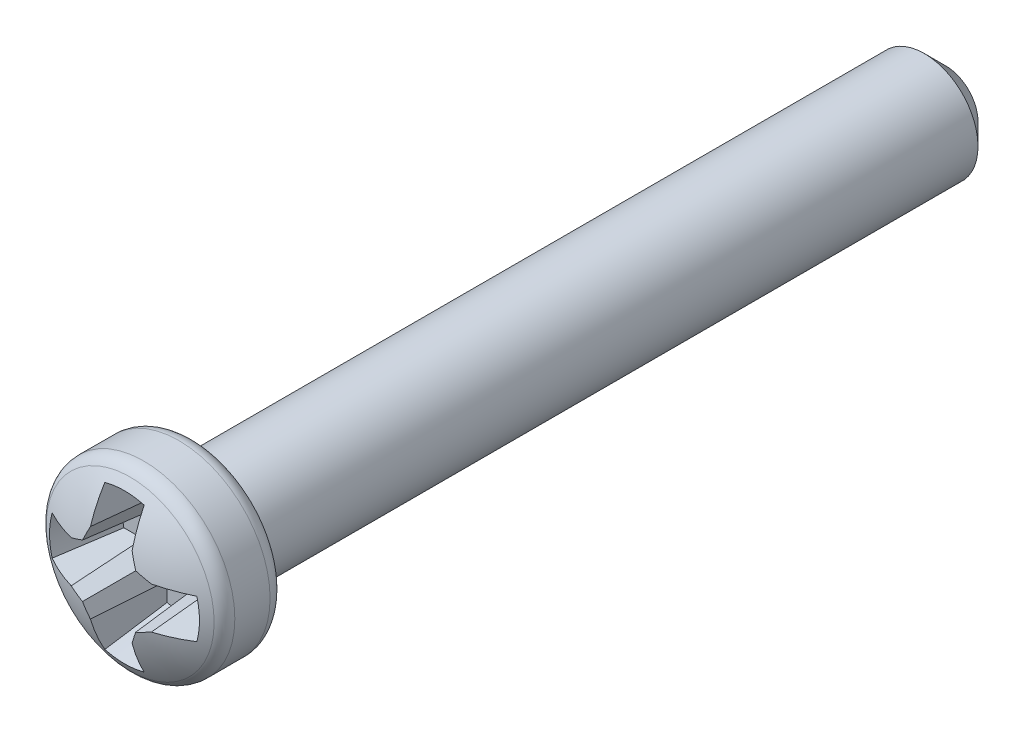
ISO-10303-21;
HEADER;
FILE_DESCRIPTION(('STEP AP214'),'2;1');
FILE_NAME('part.step','',(''),(''),'','','');
FILE_SCHEMA(('AUTOMOTIVE_DESIGN { 1 0 10303 214 1 1 1 1 }'));
ENDSEC;
DATA;
#1=APPLICATION_CONTEXT('core data for automotive mechanical design processes');
#2=APPLICATION_PROTOCOL_DEFINITION('international standard','automotive_design',2000,#1);
#3=PRODUCT_CONTEXT('',#1,'mechanical');
#4=PRODUCT('Part','Part','',(#3));
#5=PRODUCT_RELATED_PRODUCT_CATEGORY('part','',(#4));
#6=PRODUCT_DEFINITION_FORMATION('','',#4);
#7=PRODUCT_DEFINITION_CONTEXT('part definition',#1,'design');
#8=PRODUCT_DEFINITION('design','',#6,#7);
#9=PRODUCT_DEFINITION_SHAPE('','',#8);
#10=(LENGTH_UNIT() NAMED_UNIT(*) SI_UNIT(.MILLI.,.METRE.));
#11=(NAMED_UNIT(*) PLANE_ANGLE_UNIT() SI_UNIT($,.RADIAN.));
#12=(NAMED_UNIT(*) SI_UNIT($,.STERADIAN.) SOLID_ANGLE_UNIT());
#13=UNCERTAINTY_MEASURE_WITH_UNIT(LENGTH_MEASURE(1.E-05),#10,'distance_accuracy_value','');
#14=(GEOMETRIC_REPRESENTATION_CONTEXT(3) GLOBAL_UNCERTAINTY_ASSIGNED_CONTEXT((#13)) GLOBAL_UNIT_ASSIGNED_CONTEXT((#10,
#11,#12)) REPRESENTATION_CONTEXT('',''));
#15=CARTESIAN_POINT('',(0.,0.,0.));
#16=DIRECTION('',(0.,0.,1.));
#17=DIRECTION('',(1.,0.,0.));
#18=AXIS2_PLACEMENT_3D('',#15,#16,#17);
#19=CARTESIAN_POINT('',(-0.400000000000011,0.,15.7));
#20=DIRECTION('',(0.996194698091745,0.,0.0871557427476592));
#21=DIRECTION('',(0.,-1.,-1.20531199141214E-13));
#22=AXIS2_PLACEMENT_3D('',#19,#20,#21);
#23=PLANE('',#22);
#24=CARTESIAN_POINT('',(-0.155769339122426,0.,12.9084307722313));
#25=DIRECTION('',(0.996194698091745,0.,0.0871557427476592));
#26=DIRECTION('',(0.0871557427476592,0.,-0.996194698091745));
#27=AXIS2_PLACEMENT_3D('',#24,#25,#26);
#28=CIRCLE('',#27,2.77353697814506);
#29=CARTESIAN_POINT('',(-0.366942453606423,1.34976675197879,15.3221505157205));
#30=VERTEX_POINT('',#29);
#31=CARTESIAN_POINT('',(-0.388548913673451,0.747722237309709,15.5691134843641));
#32=VERTEX_POINT('',#31);
#33=EDGE_CURVE('E258',#30,#32,#28,.T.);
#34=ORIENTED_EDGE('',*,*,#33,.T.);
#35=DIRECTION('',(-0.0871426484044404,0.0173337504938601,0.996045029063886));
#36=VECTOR('',#35,1.);
#37=CARTESIAN_POINT('',(-0.400815427513501,0.750162198617128,15.7093203791284));
#38=LINE('',#37,#36);
#39=CARTESIAN_POINT('',(-0.273578881205041,0.724853275973701,14.255));
#40=VERTEX_POINT('',#39);
#41=EDGE_CURVE('E10',#40,#32,#38,.T.);
#42=ORIENTED_EDGE('',*,*,#41,.F.);
#43=DIRECTION('',(0.,-1.,0.));
#44=VECTOR('',#43,1.);
#45=CARTESIAN_POINT('',(-0.273578881205049,0.,14.255));
#46=LINE('',#45,#44);
#47=CARTESIAN_POINT('',(-0.273578881205038,1.07866041768189,14.255));
#48=VERTEX_POINT('',#47);
#49=EDGE_CURVE('E319',#48,#40,#46,.T.);
#50=ORIENTED_EDGE('',*,*,#49,.F.);
#51=CARTESIAN_POINT('',(-0.273578881205038,1.07866041768189,14.255));
#52=CARTESIAN_POINT('',(-0.304698622172029,1.16909490040446,14.6107002669011));
#53=CARTESIAN_POINT('',(-0.335820104838195,1.25945048805327,14.9664204415149));
#54=CARTESIAN_POINT('',(-0.366942453606423,1.34976675197879,15.3221505157205));
#55=(BOUNDED_CURVE() B_SPLINE_CURVE(3,(#51,#52,#53,#54),.UNSPECIFIED.,.F.,
.F.) B_SPLINE_CURVE_WITH_KNOTS((4,4),(0.0101147351762878,0.0112197354916044),
.UNSPECIFIED.) CURVE() GEOMETRIC_REPRESENTATION_ITEM() RATIONAL_B_SPLINE_CURVE((1.,1.,1.,1.)) REPRESENTATION_ITEM(''));
#56=EDGE_CURVE('E357',#48,#30,#55,.T.);
#57=ORIENTED_EDGE('',*,*,#56,.T.);
#58=EDGE_LOOP('',(#34,#42,#50,#57));
#59=FACE_BOUND('',#58,.T.);
#60=ADVANCED_FACE('F15',(#59),#23,.T.);
#61=CARTESIAN_POINT('',(-0.606586399182272,0.251256313292342,15.7));
#62=DIRECTION('',(0.920363891963223,-0.381227206369657,0.0871557427476588));
#63=DIRECTION('',(0.,-0.222868776578235,-0.974848454082234));
#64=AXIS2_PLACEMENT_3D('',#61,#62,#63);
#65=PLANE('',#64);
#66=CARTESIAN_POINT('',(-0.379146146396833,0.157047475959057,12.8861548030787));
#67=DIRECTION('',(0.920363891963223,-0.381227206369658,0.0871557427476588));
#68=DIRECTION('',(0.382683432365094,0.923879532511285,0.));
#69=AXIS2_PLACEMENT_3D('',#66,#67,#68);
#70=CIRCLE('',#69,2.74722630506);
#71=CARTESIAN_POINT('',(-0.496473166513852,0.496473166513839,15.6098062018733));
#72=VERTEX_POINT('',#71);
#73=EDGE_CURVE('E387',#32,#72,#70,.T.);
#74=ORIENTED_EDGE('',*,*,#73,.T.);
#75=DIRECTION('',(-0.0666626913468326,0.0666626913468326,0.995546167269401));
#76=VECTOR('',#75,1.);
#77=CARTESIAN_POINT('',(-0.5018585599701,0.501858559970086,15.6902321148732));
#78=LINE('',#77,#76);
#79=CARTESIAN_POINT('',(-0.405754091256932,0.405754091256919,14.255));
#80=VERTEX_POINT('',#79);
#81=EDGE_CURVE('E26',#80,#72,#78,.T.);
#82=ORIENTED_EDGE('',*,*,#81,.F.);
#83=DIRECTION('',(-0.382683432365094,-0.923879532511285,0.));
#84=VECTOR('',#83,1.);
#85=CARTESIAN_POINT('',(-0.489788515050423,0.202877045628466,14.255));
#86=LINE('',#85,#84);
#87=EDGE_CURVE('E369',#40,#80,#86,.T.);
#88=ORIENTED_EDGE('',*,*,#87,.F.);
#89=ORIENTED_EDGE('',*,*,#41,.T.);
#90=EDGE_LOOP('',(#74,#82,#88,#89));
#91=FACE_BOUND('',#90,.T.);
#92=ADVANCED_FACE('F548',(#91),#65,.T.);
#93=CARTESIAN_POINT('',(-0.251256313292353,0.606586399182252,15.7));
#94=DIRECTION('',(0.381227206369636,-0.920363891963232,0.0871557427476579));
#95=DIRECTION('',(0.,-0.0942752822069807,-0.995546167269401));
#96=AXIS2_PLACEMENT_3D('',#93,#94,#95);
#97=PLANE('',#96);
#98=CARTESIAN_POINT('',(-0.157047475959054,0.379146146396823,12.8861548030787));
#99=DIRECTION('',(0.381227206369636,-0.920363891963232,0.0871557427476579));
#100=DIRECTION('',(0.923879532511294,0.382683432365072,0.));
#101=AXIS2_PLACEMENT_3D('',#98,#99,#100);
#102=CIRCLE('',#101,2.74722630506);
#103=CARTESIAN_POINT('',(-0.747722237309725,0.388548913673444,15.5691134843641));
#104=VERTEX_POINT('',#103);
#105=EDGE_CURVE('E390',#72,#104,#102,.T.);
#106=ORIENTED_EDGE('',*,*,#105,.T.);
#107=DIRECTION('',(-0.0173337504938597,0.087142648404439,0.996045029063886));
#108=VECTOR('',#107,1.);
#109=CARTESIAN_POINT('',(-0.74977465582037,0.398867118306383,15.6870511029892));
#110=LINE('',#109,#108);
#111=CARTESIAN_POINT('',(-0.724853275973718,0.273578881205036,14.255));
#112=VERTEX_POINT('',#111);
#113=EDGE_CURVE('E346',#112,#104,#110,.T.);
#114=ORIENTED_EDGE('',*,*,#113,.F.);
#115=DIRECTION('',(-0.923879532511294,-0.382683432365072,0.));
#116=VECTOR('',#115,1.);
#117=CARTESIAN_POINT('',(-0.20287704562845,0.489788515050416,14.255));
#118=LINE('',#117,#116);
#119=EDGE_CURVE('E477',#80,#112,#118,.T.);
#120=ORIENTED_EDGE('',*,*,#119,.F.);
#121=ORIENTED_EDGE('',*,*,#81,.T.);
#122=EDGE_LOOP('',(#106,#114,#120,#121));
#123=FACE_BOUND('',#122,.T.);
#124=ADVANCED_FACE('F546',(#123),#97,.T.);
#125=CARTESIAN_POINT('',(0.,0.399999999999987,15.7));
#126=DIRECTION('',(0.,-0.996194698091746,0.0871557427476576));
#127=DIRECTION('',(-1.,0.,0.));
#128=AXIS2_PLACEMENT_3D('',#125,#126,#127);
#129=PLANE('',#128);
#130=CARTESIAN_POINT('',(0.,0.155769339122407,12.9084307722313));
#131=DIRECTION('',(0.,-0.996194698091746,0.0871557427476576));
#132=DIRECTION('',(0.,-0.0871557427476576,-0.996194698091746));
#133=AXIS2_PLACEMENT_3D('',#130,#131,#132);
#134=CIRCLE('',#133,2.77353697814506);
#135=CARTESIAN_POINT('',(-1.3497667519788,0.366942453606429,15.3221505157205));
#136=VERTEX_POINT('',#135);
#137=EDGE_CURVE('E400',#104,#136,#134,.T.);
#138=ORIENTED_EDGE('',*,*,#137,.T.);
#139=CARTESIAN_POINT('',(-1.07866041768188,0.273578881205039,14.255));
#140=CARTESIAN_POINT('',(-1.16909490040445,0.304698622172032,14.6107002669011));
#141=CARTESIAN_POINT('',(-1.25945048805327,0.335820104838199,14.9664204415149));
#142=CARTESIAN_POINT('',(-1.3497667519788,0.366942453606429,15.3221505157205));
#143=(BOUNDED_CURVE() B_SPLINE_CURVE(3,(#139,#140,#141,#142),.UNSPECIFIED.,.F.,
.F.) B_SPLINE_CURVE_WITH_KNOTS((4,4),(0.00303333154714993,0.00413833274330227),
.UNSPECIFIED.) CURVE() GEOMETRIC_REPRESENTATION_ITEM() RATIONAL_B_SPLINE_CURVE((1.,1.,1.,1.)) REPRESENTATION_ITEM(''));
#144=CARTESIAN_POINT('',(-1.07866041768188,0.273578881205039,14.255));
#145=VERTEX_POINT('',#144);
#146=EDGE_CURVE('E340',#145,#136,#143,.T.);
#147=ORIENTED_EDGE('',*,*,#146,.F.);
#148=DIRECTION('',(-1.,0.,0.));
#149=VECTOR('',#148,1.);
#150=CARTESIAN_POINT('',(0.,0.273578881205028,14.255));
#151=LINE('',#150,#149);
#152=EDGE_CURVE('E481',#112,#145,#151,.T.);
#153=ORIENTED_EDGE('',*,*,#152,.F.);
#154=ORIENTED_EDGE('',*,*,#113,.T.);
#155=EDGE_LOOP('',(#138,#147,#153,#154));
#156=FACE_BOUND('',#155,.T.);
#157=ADVANCED_FACE('F556',(#156),#129,.T.);
#158=CARTESIAN_POINT('',(0.,0.,15.7));
#159=DIRECTION('',(0.,0.,1.));
#160=DIRECTION('',(-1.,0.,0.));
#161=AXIS2_PLACEMENT_3D('',#158,#159,#160);
#162=CONICAL_SURFACE('',#161,1.5,0.26179938779915);
#163=CARTESIAN_POINT('',(0.,0.,15.3221505157205));
#164=DIRECTION('',(0.,0.,1.));
#165=DIRECTION('',(-1.,0.,0.));
#166=AXIS2_PLACEMENT_3D('',#163,#164,#165);
#167=CIRCLE('',#166,1.39875553582679);
#168=CARTESIAN_POINT('',(-1.3497667519788,-0.36694245360644,15.3221505157205));
#169=VERTEX_POINT('',#168);
#170=EDGE_CURVE('E409',#136,#169,#167,.T.);
#171=ORIENTED_EDGE('',*,*,#170,.T.);
#172=CARTESIAN_POINT('',(-1.07866041768189,-0.273578881205053,14.255));
#173=CARTESIAN_POINT('',(-1.16909490040446,-0.304698622172045,14.6107002669011));
#174=CARTESIAN_POINT('',(-1.25945048805328,-0.335820104838211,14.9664204415149));
#175=CARTESIAN_POINT('',(-1.3497667519788,-0.36694245360644,15.3221505157205));
#176=(BOUNDED_CURVE() B_SPLINE_CURVE(3,(#172,#173,#174,#175),.UNSPECIFIED.,.F.,
.F.) B_SPLINE_CURVE_WITH_KNOTS((4,4),(0.0101147351762878,0.0112197354916044),
.UNSPECIFIED.) CURVE() GEOMETRIC_REPRESENTATION_ITEM() RATIONAL_B_SPLINE_CURVE((1.,1.,1.,1.)) REPRESENTATION_ITEM(''));
#177=CARTESIAN_POINT('',(-1.07866041768189,-0.273578881205053,14.255));
#178=VERTEX_POINT('',#177);
#179=EDGE_CURVE('E347',#178,#169,#176,.T.);
#180=ORIENTED_EDGE('',*,*,#179,.F.);
#181=CARTESIAN_POINT('',(0.,0.,14.255));
#182=DIRECTION('',(0.,0.,1.));
#183=DIRECTION('',(1.,0.,0.));
#184=AXIS2_PLACEMENT_3D('',#181,#182,#183);
#185=CIRCLE('',#184,1.11281341693703);
#186=EDGE_CURVE('E254',#145,#178,#185,.T.);
#187=ORIENTED_EDGE('',*,*,#186,.F.);
#188=ORIENTED_EDGE('',*,*,#146,.T.);
#189=EDGE_LOOP('',(#171,#180,#187,#188));
#190=FACE_BOUND('',#189,.T.);
#191=ADVANCED_FACE('F630',(#190),#162,.F.);
#192=CARTESIAN_POINT('',(0.,-0.400000000000023,15.7));
#193=DIRECTION('',(0.,0.996194698091745,0.08715574274766));
#194=DIRECTION('',(1.,0.,0.));
#195=AXIS2_PLACEMENT_3D('',#192,#193,#194);
#196=PLANE('',#195);
#197=CARTESIAN_POINT('',(0.,-0.155769339122436,12.9084307722313));
#198=DIRECTION('',(0.,0.996194698091745,0.08715574274766));
#199=DIRECTION('',(0.,-0.08715574274766,0.996194698091745));
#200=AXIS2_PLACEMENT_3D('',#197,#198,#199);
#201=CIRCLE('',#200,2.77353697814506);
#202=CARTESIAN_POINT('',(-0.74772223730972,-0.388548913673466,15.5691134843641));
#203=VERTEX_POINT('',#202);
#204=EDGE_CURVE('E296',#169,#203,#201,.T.);
#205=ORIENTED_EDGE('',*,*,#204,.T.);
#206=DIRECTION('',(-0.0173337504938606,-0.0871426484044413,0.996045029063886));
#207=VECTOR('',#206,1.);
#208=CARTESIAN_POINT('',(-0.75016219861714,-0.400815427513517,15.7093203791284));
#209=LINE('',#208,#207);
#210=CARTESIAN_POINT('',(-0.724853275973712,-0.273578881205055,14.255));
#211=VERTEX_POINT('',#210);
#212=EDGE_CURVE('E233',#211,#203,#209,.T.);
#213=ORIENTED_EDGE('',*,*,#212,.F.);
#214=DIRECTION('',(1.,0.,0.));
#215=VECTOR('',#214,1.);
#216=CARTESIAN_POINT('',(0.,-0.27357888120506,14.255));
#217=LINE('',#216,#215);
#218=EDGE_CURVE('E247',#178,#211,#217,.T.);
#219=ORIENTED_EDGE('',*,*,#218,.F.);
#220=ORIENTED_EDGE('',*,*,#179,.T.);
#221=EDGE_LOOP('',(#205,#213,#219,#220));
#222=FACE_BOUND('',#221,.T.);
#223=ADVANCED_FACE('F627',(#222),#196,.T.);
#224=CARTESIAN_POINT('',(-0.251256313292352,-0.606586399182285,15.7));
#225=DIRECTION('',(0.381227206369654,0.920363891963224,0.0871557427476598));
#226=DIRECTION('',(0.22286877657824,0.,-0.974848454082233));
#227=AXIS2_PLACEMENT_3D('',#224,#225,#226);
#228=PLANE('',#227);
#229=CARTESIAN_POINT('',(-0.157047475959065,-0.379146146396845,12.8861548030787));
#230=DIRECTION('',(0.381227206369653,0.920363891963224,0.0871557427476598));
#231=DIRECTION('',(-0.923879532511287,0.38268343236509,0.));
#232=AXIS2_PLACEMENT_3D('',#229,#230,#231);
#233=CIRCLE('',#232,2.74722630506);
#234=CARTESIAN_POINT('',(-0.49647316651385,-0.496473166513867,15.6098062018733));
#235=VERTEX_POINT('',#234);
#236=EDGE_CURVE('E228',#203,#235,#233,.T.);
#237=ORIENTED_EDGE('',*,*,#236,.T.);
#238=DIRECTION('',(-0.0666626913468331,-0.0666626913468336,0.995546167269401));
#239=VECTOR('',#238,1.);
#240=CARTESIAN_POINT('',(-0.501858559970097,-0.501858559970114,15.6902321148732));
#241=LINE('',#240,#239);
#242=CARTESIAN_POINT('',(-0.405754091256929,-0.405754091256945,14.255));
#243=VERTEX_POINT('',#242);
#244=EDGE_CURVE('E221',#243,#235,#241,.T.);
#245=ORIENTED_EDGE('',*,*,#244,.F.);
#246=DIRECTION('',(0.923879532511287,-0.38268343236509,0.));
#247=VECTOR('',#246,1.);
#248=CARTESIAN_POINT('',(-0.20287704562847,-0.489788515050438,14.255));
#249=LINE('',#248,#247);
#250=EDGE_CURVE('E225',#211,#243,#249,.T.);
#251=ORIENTED_EDGE('',*,*,#250,.F.);
#252=ORIENTED_EDGE('',*,*,#212,.T.);
#253=EDGE_LOOP('',(#237,#245,#251,#252));
#254=FACE_BOUND('',#253,.T.);
#255=ADVANCED_FACE('F223',(#254),#228,.T.);
#256=CARTESIAN_POINT('',(-0.606586399182264,-0.251256313292368,15.7));
#257=DIRECTION('',(0.920363891963231,0.381227206369638,0.087155742747659));
#258=DIRECTION('',(0.,0.222868776578246,-0.974848454082231));
#259=AXIS2_PLACEMENT_3D('',#256,#257,#258);
#260=PLANE('',#259);
#261=CARTESIAN_POINT('',(-0.379146146396833,-0.157047475959064,12.8861548030787));
#262=DIRECTION('',(0.92036389196323,0.381227206369639,0.087155742747659));
#263=DIRECTION('',(-0.382683432365075,0.923879532511293,0.));
#264=AXIS2_PLACEMENT_3D('',#261,#262,#263);
#265=CIRCLE('',#264,2.74722630506);
#266=CARTESIAN_POINT('',(-0.388548913673453,-0.747722237309739,15.5691134843641));
#267=VERTEX_POINT('',#266);
#268=EDGE_CURVE('E274',#235,#267,#265,.T.);
#269=ORIENTED_EDGE('',*,*,#268,.T.);
#270=DIRECTION('',(-0.0871426484044398,-0.0173337504938608,0.996045029063886));
#271=VECTOR('',#270,1.);
#272=CARTESIAN_POINT('',(-0.398867118306393,-0.749774655820384,15.6870511029892));
#273=LINE('',#272,#271);
#274=CARTESIAN_POINT('',(-0.273578881205045,-0.724853275973731,14.255));
#275=VERTEX_POINT('',#274);
#276=EDGE_CURVE('E234',#275,#267,#273,.T.);
#277=ORIENTED_EDGE('',*,*,#276,.F.);
#278=DIRECTION('',(0.382683432365075,-0.923879532511293,0.));
#279=VECTOR('',#278,1.);
#280=CARTESIAN_POINT('',(-0.48978851505043,-0.202877045628457,14.255));
#281=LINE('',#280,#279);
#282=EDGE_CURVE('E237',#243,#275,#281,.T.);
#283=ORIENTED_EDGE('',*,*,#282,.F.);
#284=ORIENTED_EDGE('',*,*,#244,.T.);
#285=EDGE_LOOP('',(#269,#277,#283,#284));
#286=FACE_BOUND('',#285,.T.);
#287=ADVANCED_FACE('F238',(#286),#260,.T.);
#288=CARTESIAN_POINT('',(-0.4,0.,15.7));
#289=DIRECTION('',(0.996194698091746,0.,0.0871557427476584));
#290=DIRECTION('',(0.,-1.,0.));
#291=AXIS2_PLACEMENT_3D('',#288,#289,#290);
#292=PLANE('',#291);
#293=CARTESIAN_POINT('',(-0.155769339122418,0.,12.9084307722313));
#294=DIRECTION('',(0.996194698091746,0.,0.0871557427476584));
#295=DIRECTION('',(0.0871557427476584,0.,-0.996194698091746));
#296=AXIS2_PLACEMENT_3D('',#293,#294,#295);
#297=CIRCLE('',#296,2.77353697814506);
#298=CARTESIAN_POINT('',(-0.366942453606437,-1.34976675197881,15.3221505157205));
#299=VERTEX_POINT('',#298);
#300=EDGE_CURVE('E267',#267,#299,#297,.T.);
#301=ORIENTED_EDGE('',*,*,#300,.T.);
#302=CARTESIAN_POINT('',(-0.273578881205047,-1.07866041768189,14.255));
#303=CARTESIAN_POINT('',(-0.304698622172039,-1.16909490040447,14.6107002669011));
#304=CARTESIAN_POINT('',(-0.335820104838207,-1.25945048805328,14.9664204415149));
#305=CARTESIAN_POINT('',(-0.366942453606437,-1.34976675197881,15.3221505157205));
#306=(BOUNDED_CURVE() B_SPLINE_CURVE(3,(#302,#303,#304,#305),.UNSPECIFIED.,.F.,
.F.) B_SPLINE_CURVE_WITH_KNOTS((4,4),(0.00303333154714993,0.00413833274330227),
.UNSPECIFIED.) CURVE() GEOMETRIC_REPRESENTATION_ITEM() RATIONAL_B_SPLINE_CURVE((1.,1.,1.,1.)) REPRESENTATION_ITEM(''));
#307=CARTESIAN_POINT('',(-0.273578881205047,-1.07866041768189,14.255));
#308=VERTEX_POINT('',#307);
#309=EDGE_CURVE('E260',#308,#299,#306,.T.);
#310=ORIENTED_EDGE('',*,*,#309,.F.);
#311=DIRECTION('',(0.,-1.,0.));
#312=VECTOR('',#311,1.);
#313=CARTESIAN_POINT('',(-0.27357888120504,0.,14.255));
#314=LINE('',#313,#312);
#315=EDGE_CURVE('E242',#275,#308,#314,.T.);
#316=ORIENTED_EDGE('',*,*,#315,.F.);
#317=ORIENTED_EDGE('',*,*,#276,.T.);
#318=EDGE_LOOP('',(#301,#310,#316,#317));
#319=FACE_BOUND('',#318,.T.);
#320=ADVANCED_FACE('F590',(#319),#292,.T.);
#321=CARTESIAN_POINT('',(0.400000000000011,0.,15.7));
#322=DIRECTION('',(-0.996194698091745,0.,0.0871557427476592));
#323=DIRECTION('',(0.,1.,0.));
#324=AXIS2_PLACEMENT_3D('',#321,#322,#323);
#325=PLANE('',#324);
#326=CARTESIAN_POINT('',(0.155769339122426,0.,12.9084307722313));
#327=DIRECTION('',(-0.996194698091745,0.,0.0871557427476592));
#328=DIRECTION('',(0.0871557427476592,0.,0.996194698091745));
#329=AXIS2_PLACEMENT_3D('',#326,#327,#328);
#330=CIRCLE('',#329,2.77353697814506);
#331=CARTESIAN_POINT('',(0.366942453606433,-1.34976675197881,15.3221505157205));
#332=VERTEX_POINT('',#331);
#333=CARTESIAN_POINT('',(0.388548913673456,-0.747722237309731,15.5691134843641));
#334=VERTEX_POINT('',#333);
#335=EDGE_CURVE('E370',#332,#334,#330,.T.);
#336=ORIENTED_EDGE('',*,*,#335,.T.);
#337=DIRECTION('',(0.0871426484044404,-0.0173337504938611,0.996045029063886));
#338=VECTOR('',#337,1.);
#339=CARTESIAN_POINT('',(0.400815427513507,-0.750162198617151,15.7093203791284));
#340=LINE('',#339,#338);
#341=CARTESIAN_POINT('',(0.273578881205046,-0.724853275973723,14.255));
#342=VERTEX_POINT('',#341);
#343=EDGE_CURVE('E288',#342,#334,#340,.T.);
#344=ORIENTED_EDGE('',*,*,#343,.F.);
#345=DIRECTION('',(0.,1.,0.));
#346=VECTOR('',#345,1.);
#347=CARTESIAN_POINT('',(0.273578881205049,0.,14.255));
#348=LINE('',#347,#346);
#349=CARTESIAN_POINT('',(0.273578881205045,-1.0786604176819,14.255));
#350=VERTEX_POINT('',#349);
#351=EDGE_CURVE('E307',#350,#342,#348,.T.);
#352=ORIENTED_EDGE('',*,*,#351,.F.);
#353=CARTESIAN_POINT('',(0.273578881205045,-1.0786604176819,14.255));
#354=CARTESIAN_POINT('',(0.304698622172037,-1.16909490040448,14.6107002669011));
#355=CARTESIAN_POINT('',(0.335820104838204,-1.25945048805329,14.9664204415149));
#356=CARTESIAN_POINT('',(0.366942453606433,-1.34976675197881,15.3221505157205));
#357=(BOUNDED_CURVE() B_SPLINE_CURVE(3,(#353,#354,#355,#356),.UNSPECIFIED.,.F.,
.F.) B_SPLINE_CURVE_WITH_KNOTS((4,4),(0.0101147351762878,0.0112197354916044),
.UNSPECIFIED.) CURVE() GEOMETRIC_REPRESENTATION_ITEM() RATIONAL_B_SPLINE_CURVE((1.,1.,1.,1.)) REPRESENTATION_ITEM(''));
#358=EDGE_CURVE('E265',#350,#332,#357,.T.);
#359=ORIENTED_EDGE('',*,*,#358,.T.);
#360=EDGE_LOOP('',(#336,#344,#352,#359));
#361=FACE_BOUND('',#360,.T.);
#362=ADVANCED_FACE('F594',(#361),#325,.T.);
#363=CARTESIAN_POINT('',(0.606586399182273,-0.251256313292363,15.7));
#364=DIRECTION('',(-0.920363891963225,0.381227206369651,0.0871557427476594));
#365=DIRECTION('',(0.094275282206983,0.,0.995546167269401));
#366=AXIS2_PLACEMENT_3D('',#363,#364,#365);
#367=PLANE('',#366);
#368=CARTESIAN_POINT('',(0.379146146396836,-0.157047475959071,12.8861548030787));
#369=DIRECTION('',(-0.920363891963225,0.38122720636965,0.0871557427476594));
#370=DIRECTION('',(-0.382683432365087,-0.923879532511288,0.));
#371=AXIS2_PLACEMENT_3D('',#368,#369,#370);
#372=CIRCLE('',#371,2.74722630506);
#373=CARTESIAN_POINT('',(0.496473166513856,-0.496473166513861,15.6098062018733));
#374=VERTEX_POINT('',#373);
#375=EDGE_CURVE('E311',#334,#374,#372,.T.);
#376=ORIENTED_EDGE('',*,*,#375,.T.);
#377=DIRECTION('',(0.066662691346833,-0.0666626913468337,0.995546167269401));
#378=VECTOR('',#377,1.);
#379=CARTESIAN_POINT('',(0.501858559970103,-0.501858559970108,15.6902321148732));
#380=LINE('',#379,#378);
#381=CARTESIAN_POINT('',(0.405754091256935,-0.405754091256939,14.255));
#382=VERTEX_POINT('',#381);
#383=EDGE_CURVE('E40',#382,#374,#380,.T.);
#384=ORIENTED_EDGE('',*,*,#383,.F.);
#385=DIRECTION('',(0.382683432365087,0.923879532511288,0.));
#386=VECTOR('',#385,1.);
#387=CARTESIAN_POINT('',(0.489788515050433,-0.202877045628466,14.255));
#388=LINE('',#387,#386);
#389=EDGE_CURVE('E302',#342,#382,#388,.T.);
#390=ORIENTED_EDGE('',*,*,#389,.F.);
#391=ORIENTED_EDGE('',*,*,#343,.T.);
#392=EDGE_LOOP('',(#376,#384,#390,#391));
#393=FACE_BOUND('',#392,.T.);
#394=ADVANCED_FACE('F595',(#393),#367,.T.);
#395=CARTESIAN_POINT('',(0.251256313292357,-0.606586399182276,15.7));
#396=DIRECTION('',(-0.381227206369642,0.920363891963229,0.0871557427476594));
#397=DIRECTION('',(0.222868776578245,0.,0.974848454082231));
#398=AXIS2_PLACEMENT_3D('',#395,#396,#397);
#399=PLANE('',#398);
#400=CARTESIAN_POINT('',(0.157047475959058,-0.379146146396842,12.8861548030787));
#401=DIRECTION('',(-0.381227206369641,0.920363891963229,0.0871557427476594));
#402=DIRECTION('',(-0.923879532511292,-0.382683432365078,0.));
#403=AXIS2_PLACEMENT_3D('',#400,#401,#402);
#404=CIRCLE('',#403,2.74722630506);
#405=CARTESIAN_POINT('',(0.747722237309727,-0.388548913673463,15.5691134843641));
#406=VERTEX_POINT('',#405);
#407=EDGE_CURVE('E308',#374,#406,#404,.T.);
#408=ORIENTED_EDGE('',*,*,#407,.T.);
#409=DIRECTION('',(0.0173337504938603,-0.0871426484044405,0.996045029063886));
#410=VECTOR('',#409,1.);
#411=CARTESIAN_POINT('',(0.749774655820373,-0.398867118306403,15.6870511029892));
#412=LINE('',#411,#410);
#413=CARTESIAN_POINT('',(0.72485327597372,-0.273578881205054,14.255));
#414=VERTEX_POINT('',#413);
#415=EDGE_CURVE('E106',#414,#406,#412,.T.);
#416=ORIENTED_EDGE('',*,*,#415,.F.);
#417=DIRECTION('',(0.923879532511292,0.382683432365078,0.));
#418=VECTOR('',#417,1.);
#419=CARTESIAN_POINT('',(0.202877045628462,-0.489788515050434,14.255));
#420=LINE('',#419,#418);
#421=EDGE_CURVE('E306',#382,#414,#420,.T.);
#422=ORIENTED_EDGE('',*,*,#421,.F.);
#423=ORIENTED_EDGE('',*,*,#383,.T.);
#424=EDGE_LOOP('',(#408,#416,#422,#423));
#425=FACE_BOUND('',#424,.T.);
#426=ADVANCED_FACE('F598',(#425),#399,.T.);
#427=CARTESIAN_POINT('',(0.,-0.400000000000013,15.7));
#428=DIRECTION('',(0.,0.996194698091745,0.0871557427476592));
#429=DIRECTION('',(1.,0.,0.));
#430=AXIS2_PLACEMENT_3D('',#427,#428,#429);
#431=PLANE('',#430);
#432=CARTESIAN_POINT('',(0.,-0.155769339122428,12.9084307722313));
#433=DIRECTION('',(0.,0.996194698091745,0.0871557427476592));
#434=DIRECTION('',(0.,-0.0871557427476592,0.996194698091745));
#435=AXIS2_PLACEMENT_3D('',#432,#433,#434);
#436=CIRCLE('',#435,2.77353697814506);
#437=CARTESIAN_POINT('',(1.3497667519788,-0.366942453606444,15.3221505157205));
#438=VERTEX_POINT('',#437);
#439=EDGE_CURVE('E312',#406,#438,#436,.T.);
#440=ORIENTED_EDGE('',*,*,#439,.T.);
#441=CARTESIAN_POINT('',(1.07866041768188,-0.273578881205055,14.255));
#442=CARTESIAN_POINT('',(1.16909490040446,-0.304698622172047,14.6107002669011));
#443=CARTESIAN_POINT('',(1.25945048805327,-0.335820104838214,14.9664204415149));
#444=CARTESIAN_POINT('',(1.3497667519788,-0.366942453606444,15.3221505157205));
#445=(BOUNDED_CURVE() B_SPLINE_CURVE(3,(#441,#442,#443,#444),.UNSPECIFIED.,.F.,
.F.) B_SPLINE_CURVE_WITH_KNOTS((4,4),(0.00303333154714993,0.00413833274330227),
.UNSPECIFIED.) CURVE() GEOMETRIC_REPRESENTATION_ITEM() RATIONAL_B_SPLINE_CURVE((1.,1.,1.,1.)) REPRESENTATION_ITEM(''));
#446=CARTESIAN_POINT('',(1.07866041768188,-0.273578881205055,14.255));
#447=VERTEX_POINT('',#446);
#448=EDGE_CURVE('E122',#447,#438,#445,.T.);
#449=ORIENTED_EDGE('',*,*,#448,.F.);
#450=DIRECTION('',(1.,0.,0.));
#451=VECTOR('',#450,1.);
#452=CARTESIAN_POINT('',(0.,-0.273578881205051,14.255));
#453=LINE('',#452,#451);
#454=EDGE_CURVE('E316',#414,#447,#453,.T.);
#455=ORIENTED_EDGE('',*,*,#454,.F.);
#456=ORIENTED_EDGE('',*,*,#415,.T.);
#457=EDGE_LOOP('',(#440,#449,#455,#456));
#458=FACE_BOUND('',#457,.T.);
#459=ADVANCED_FACE('F604',(#458),#431,.T.);
#460=CARTESIAN_POINT('',(0.,0.,14.255));
#461=DIRECTION('',(0.,0.,1.));
#462=DIRECTION('',(1.,0.,0.));
#463=AXIS2_PLACEMENT_3D('',#460,#461,#462);
#464=PLANE('',#463);
#465=ORIENTED_EDGE('',*,*,#454,.T.);
#466=CARTESIAN_POINT('',(0.,0.,14.255));
#467=DIRECTION('',(0.,0.,1.));
#468=DIRECTION('',(1.,0.,0.));
#469=AXIS2_PLACEMENT_3D('',#466,#467,#468);
#470=CIRCLE('',#469,1.11281341693703);
#471=CARTESIAN_POINT('',(1.07866041768189,0.273578881205037,14.255));
#472=VERTEX_POINT('',#471);
#473=EDGE_CURVE('E424',#447,#472,#470,.T.);
#474=ORIENTED_EDGE('',*,*,#473,.T.);
#475=DIRECTION('',(-1.,0.,0.));
#476=VECTOR('',#475,1.);
#477=CARTESIAN_POINT('',(0.,0.273578881205037,14.255));
#478=LINE('',#477,#476);
#479=CARTESIAN_POINT('',(0.72485327597371,0.273578881205037,14.255));
#480=VERTEX_POINT('',#479);
#481=EDGE_CURVE('E320',#472,#480,#478,.T.);
#482=ORIENTED_EDGE('',*,*,#481,.T.);
#483=DIRECTION('',(-0.923879532511289,0.382683432365084,0.));
#484=VECTOR('',#483,1.);
#485=CARTESIAN_POINT('',(0.202877045628459,0.489788515050419,14.255));
#486=LINE('',#485,#484);
#487=CARTESIAN_POINT('',(0.405754091256926,0.405754091256924,14.255));
#488=VERTEX_POINT('',#487);
#489=EDGE_CURVE('E336',#480,#488,#486,.T.);
#490=ORIENTED_EDGE('',*,*,#489,.T.);
#491=DIRECTION('',(-0.382683432365081,0.92387953251129,0.));
#492=VECTOR('',#491,1.);
#493=CARTESIAN_POINT('',(0.48978851505042,0.202877045628457,14.255));
#494=LINE('',#493,#492);
#495=CARTESIAN_POINT('',(0.273578881205039,0.724853275973709,14.255));
#496=VERTEX_POINT('',#495);
#497=EDGE_CURVE('E281',#488,#496,#494,.T.);
#498=ORIENTED_EDGE('',*,*,#497,.T.);
#499=DIRECTION('',(0.,1.,0.));
#500=VECTOR('',#499,1.);
#501=CARTESIAN_POINT('',(0.27357888120504,0.,14.255));
#502=LINE('',#501,#500);
#503=CARTESIAN_POINT('',(0.273578881205039,1.07866041768189,14.255));
#504=VERTEX_POINT('',#503);
#505=EDGE_CURVE('E327',#496,#504,#502,.T.);
#506=ORIENTED_EDGE('',*,*,#505,.T.);
#507=CARTESIAN_POINT('',(0.,0.,14.255));
#508=DIRECTION('',(0.,0.,1.));
#509=DIRECTION('',(1.,0.,0.));
#510=AXIS2_PLACEMENT_3D('',#507,#508,#509);
#511=CIRCLE('',#510,1.11281341693703);
#512=EDGE_CURVE('E328',#504,#48,#511,.T.);
#513=ORIENTED_EDGE('',*,*,#512,.T.);
#514=ORIENTED_EDGE('',*,*,#49,.T.);
#515=ORIENTED_EDGE('',*,*,#87,.T.);
#516=ORIENTED_EDGE('',*,*,#119,.T.);
#517=ORIENTED_EDGE('',*,*,#152,.T.);
#518=ORIENTED_EDGE('',*,*,#186,.T.);
#519=ORIENTED_EDGE('',*,*,#218,.T.);
#520=ORIENTED_EDGE('',*,*,#250,.T.);
#521=ORIENTED_EDGE('',*,*,#282,.T.);
#522=ORIENTED_EDGE('',*,*,#315,.T.);
#523=CARTESIAN_POINT('',(0.,0.,14.255));
#524=DIRECTION('',(0.,0.,1.));
#525=DIRECTION('',(1.,0.,0.));
#526=AXIS2_PLACEMENT_3D('',#523,#524,#525);
#527=CIRCLE('',#526,1.11281341693703);
#528=EDGE_CURVE('E266',#308,#350,#527,.T.);
#529=ORIENTED_EDGE('',*,*,#528,.T.);
#530=ORIENTED_EDGE('',*,*,#351,.T.);
#531=ORIENTED_EDGE('',*,*,#389,.T.);
#532=ORIENTED_EDGE('',*,*,#421,.T.);
#533=EDGE_LOOP('',(#465,#474,#482,#490,#498,#506,#513,#514,#515,#516,#517,#518,#519,#520,#521,
#522,#529,#530,#531,#532));
#534=FACE_BOUND('',#533,.T.);
#535=ADVANCED_FACE('F244',(#534),#464,.T.);
#536=CARTESIAN_POINT('',(0.,0.4,15.7));
#537=DIRECTION('',(0.,-0.996194698091746,0.0871557427476584));
#538=DIRECTION('',(-1.,0.,0.));
#539=AXIS2_PLACEMENT_3D('',#536,#537,#538);
#540=PLANE('',#539);
#541=CARTESIAN_POINT('',(0.,0.155769339122415,12.9084307722313));
#542=DIRECTION('',(0.,-0.996194698091746,0.0871557427476584));
#543=DIRECTION('',(0.,-0.0871557427476584,-0.996194698091746));
#544=AXIS2_PLACEMENT_3D('',#541,#542,#543);
#545=CIRCLE('',#544,2.77353697814506);
#546=CARTESIAN_POINT('',(1.3497667519788,0.366942453606425,15.3221505157205));
#547=VERTEX_POINT('',#546);
#548=CARTESIAN_POINT('',(0.747722237309717,0.388548913673446,15.5691134843641));
#549=VERTEX_POINT('',#548);
#550=EDGE_CURVE('E416',#547,#549,#545,.T.);
#551=ORIENTED_EDGE('',*,*,#550,.T.);
#552=DIRECTION('',(0.0173337504938599,0.0871426484044397,0.996045029063886));
#553=VECTOR('',#552,1.);
#554=CARTESIAN_POINT('',(0.750162198617137,0.400815427513497,15.7093203791284));
#555=LINE('',#554,#553);
#556=EDGE_CURVE('E339',#480,#549,#555,.T.);
#557=ORIENTED_EDGE('',*,*,#556,.F.);
#558=ORIENTED_EDGE('',*,*,#481,.F.);
#559=CARTESIAN_POINT('',(1.07866041768189,0.273578881205037,14.255));
#560=CARTESIAN_POINT('',(1.16909490040446,0.304698622172029,14.6107002669011));
#561=CARTESIAN_POINT('',(1.25945048805327,0.335820104838196,14.9664204415149));
#562=CARTESIAN_POINT('',(1.3497667519788,0.366942453606425,15.3221505157205));
#563=(BOUNDED_CURVE() B_SPLINE_CURVE(3,(#559,#560,#561,#562),.UNSPECIFIED.,.F.,
.F.) B_SPLINE_CURVE_WITH_KNOTS((4,4),(0.0101147351762878,0.0112197354916044),
.UNSPECIFIED.) CURVE() GEOMETRIC_REPRESENTATION_ITEM() RATIONAL_B_SPLINE_CURVE((1.,1.,1.,1.)) REPRESENTATION_ITEM(''));
#564=EDGE_CURVE('E362',#472,#547,#563,.T.);
#565=ORIENTED_EDGE('',*,*,#564,.T.);
#566=EDGE_LOOP('',(#551,#557,#558,#565));
#567=FACE_BOUND('',#566,.T.);
#568=ADVANCED_FACE('F457',(#567),#540,.T.);
#569=CARTESIAN_POINT('',(0.251256313292348,0.606586399182262,15.7));
#570=DIRECTION('',(-0.381227206369648,-0.920363891963227,0.0871557427476584));
#571=DIRECTION('',(-0.923879532511289,0.382683432365084,0.));
#572=AXIS2_PLACEMENT_3D('',#569,#570,#571);
#573=PLANE('',#572);
#574=CARTESIAN_POINT('',(0.157047475959061,0.379146146396826,12.8861548030787));
#575=DIRECTION('',(-0.381227206369648,-0.920363891963227,0.0871557427476584));
#576=DIRECTION('',(0.923879532511289,-0.382683432365084,0.));
#577=AXIS2_PLACEMENT_3D('',#574,#575,#576);
#578=CIRCLE('',#577,2.74722630506);
#579=CARTESIAN_POINT('',(0.496473166513847,0.496473166513845,15.6098062018733));
#580=VERTEX_POINT('',#579);
#581=EDGE_CURVE('E420',#549,#580,#578,.T.);
#582=ORIENTED_EDGE('',*,*,#581,.T.);
#583=DIRECTION('',(0.0666626913468327,0.0666626913468325,0.995546167269401));
#584=VECTOR('',#583,1.);
#585=CARTESIAN_POINT('',(0.501858559970094,0.501858559970092,15.6902321148732));
#586=LINE('',#585,#584);
#587=EDGE_CURVE('E284',#488,#580,#586,.T.);
#588=ORIENTED_EDGE('',*,*,#587,.F.);
#589=ORIENTED_EDGE('',*,*,#489,.F.);
#590=ORIENTED_EDGE('',*,*,#556,.T.);
#591=EDGE_LOOP('',(#582,#588,#589,#590));
#592=FACE_BOUND('',#591,.T.);
#593=ADVANCED_FACE('F451',(#592),#573,.T.);
#594=CARTESIAN_POINT('',(0.606586399182262,0.251256313292347,15.7));
#595=DIRECTION('',(-0.920363891963228,-0.381227206369645,0.0871557427476583));
#596=DIRECTION('',(-0.382683432365081,0.92387953251129,0.));
#597=AXIS2_PLACEMENT_3D('',#594,#595,#596);
#598=PLANE('',#597);
#599=CARTESIAN_POINT('',(0.37914614639683,0.15704747595905,12.8861548030787));
#600=DIRECTION('',(-0.920363891963228,-0.381227206369645,0.0871557427476583));
#601=DIRECTION('',(0.382683432365081,-0.92387953251129,0.));
#602=AXIS2_PLACEMENT_3D('',#599,#600,#601);
#603=CIRCLE('',#602,2.74722630506);
#604=CARTESIAN_POINT('',(0.388548913673448,0.747722237309716,15.5691134843641));
#605=VERTEX_POINT('',#604);
#606=EDGE_CURVE('E431',#580,#605,#603,.T.);
#607=ORIENTED_EDGE('',*,*,#606,.T.);
#608=DIRECTION('',(0.0871426484044397,0.0173337504938598,0.996045029063886));
#609=VECTOR('',#608,1.);
#610=CARTESIAN_POINT('',(0.398867118306387,0.749774655820362,15.6870511029892));
#611=LINE('',#610,#609);
#612=EDGE_CURVE('E285',#496,#605,#611,.T.);
#613=ORIENTED_EDGE('',*,*,#612,.F.);
#614=ORIENTED_EDGE('',*,*,#497,.F.);
#615=ORIENTED_EDGE('',*,*,#587,.T.);
#616=EDGE_LOOP('',(#607,#613,#614,#615));
#617=FACE_BOUND('',#616,.T.);
#618=ADVANCED_FACE('F647',(#617),#598,.T.);
#619=CARTESIAN_POINT('',(0.4,0.,15.7));
#620=DIRECTION('',(-0.996194698091746,0.,0.0871557427476584));
#621=DIRECTION('',(0.,1.,0.));
#622=AXIS2_PLACEMENT_3D('',#619,#620,#621);
#623=PLANE('',#622);
#624=CARTESIAN_POINT('',(0.155769339122418,0.,12.9084307722313));
#625=DIRECTION('',(-0.996194698091746,0.,0.0871557427476584));
#626=DIRECTION('',(0.0871557427476584,0.,0.996194698091746));
#627=AXIS2_PLACEMENT_3D('',#624,#625,#626);
#628=CIRCLE('',#627,2.77353697814506);
#629=CARTESIAN_POINT('',(0.366942453606427,1.34976675197879,15.3221505157205));
#630=VERTEX_POINT('',#629);
#631=EDGE_CURVE('E335',#605,#630,#628,.T.);
#632=ORIENTED_EDGE('',*,*,#631,.T.);
#633=CARTESIAN_POINT('',(0.273578881205039,1.07866041768189,14.255));
#634=CARTESIAN_POINT('',(0.304698622172031,1.16909490040446,14.6107002669011));
#635=CARTESIAN_POINT('',(0.335820104838198,1.25945048805327,14.9664204415149));
#636=CARTESIAN_POINT('',(0.366942453606427,1.34976675197879,15.3221505157205));
#637=(BOUNDED_CURVE() B_SPLINE_CURVE(3,(#633,#634,#635,#636),.UNSPECIFIED.,.F.,
.F.) B_SPLINE_CURVE_WITH_KNOTS((4,4),(0.00303333154714993,0.00413833274330227),
.UNSPECIFIED.) CURVE() GEOMETRIC_REPRESENTATION_ITEM() RATIONAL_B_SPLINE_CURVE((1.,1.,1.,1.)) REPRESENTATION_ITEM(''));
#638=EDGE_CURVE('E321',#504,#630,#637,.T.);
#639=ORIENTED_EDGE('',*,*,#638,.F.);
#640=ORIENTED_EDGE('',*,*,#505,.F.);
#641=ORIENTED_EDGE('',*,*,#612,.T.);
#642=EDGE_LOOP('',(#632,#639,#640,#641));
#643=FACE_BOUND('',#642,.T.);
#644=ADVANCED_FACE('F650',(#643),#623,.T.);
#645=CARTESIAN_POINT('',(0.,0.,15.7));
#646=DIRECTION('',(0.,0.,1.));
#647=DIRECTION('',(1.,0.,0.));
#648=AXIS2_PLACEMENT_3D('',#645,#646,#647);
#649=CONICAL_SURFACE('',#648,1.5,0.26179938779915);
#650=CARTESIAN_POINT('',(0.,0.,15.3221505157205));
#651=DIRECTION('',(0.,0.,1.));
#652=DIRECTION('',(-1.,0.,0.));
#653=AXIS2_PLACEMENT_3D('',#650,#651,#652);
#654=CIRCLE('',#653,1.39875553582679);
#655=EDGE_CURVE('E292',#630,#30,#654,.T.);
#656=ORIENTED_EDGE('',*,*,#655,.T.);
#657=ORIENTED_EDGE('',*,*,#56,.F.);
#658=ORIENTED_EDGE('',*,*,#512,.F.);
#659=ORIENTED_EDGE('',*,*,#638,.T.);
#660=EDGE_LOOP('',(#656,#657,#658,#659));
#661=FACE_BOUND('',#660,.T.);
#662=ADVANCED_FACE('F677',(#661),#649,.F.);
#663=CARTESIAN_POINT('',(0.,0.,15.7));
#664=DIRECTION('',(0.,0.,1.));
#665=DIRECTION('',(1.,0.,0.));
#666=AXIS2_PLACEMENT_3D('',#663,#664,#665);
#667=CONICAL_SURFACE('',#666,1.5,0.26179938779915);
#668=ORIENTED_EDGE('',*,*,#473,.F.);
#669=ORIENTED_EDGE('',*,*,#448,.T.);
#670=CARTESIAN_POINT('',(0.,0.,15.3221505157205));
#671=DIRECTION('',(0.,0.,1.));
#672=DIRECTION('',(-1.,0.,0.));
#673=AXIS2_PLACEMENT_3D('',#670,#671,#672);
#674=CIRCLE('',#673,1.39875553582679);
#675=EDGE_CURVE('E378',#438,#547,#674,.T.);
#676=ORIENTED_EDGE('',*,*,#675,.T.);
#677=ORIENTED_EDGE('',*,*,#564,.F.);
#678=EDGE_LOOP('',(#668,#669,#676,#677));
#679=FACE_BOUND('',#678,.T.);
#680=ADVANCED_FACE('F674',(#679),#667,.F.);
#681=CARTESIAN_POINT('',(0.,0.,15.7));
#682=DIRECTION('',(0.,0.,1.));
#683=DIRECTION('',(0.,-1.,0.));
#684=AXIS2_PLACEMENT_3D('',#681,#682,#683);
#685=CONICAL_SURFACE('',#684,1.5,0.26179938779915);
#686=ORIENTED_EDGE('',*,*,#528,.F.);
#687=ORIENTED_EDGE('',*,*,#309,.T.);
#688=CARTESIAN_POINT('',(0.,0.,15.3221505157205));
#689=DIRECTION('',(0.,0.,1.));
#690=DIRECTION('',(0.,1.,0.));
#691=AXIS2_PLACEMENT_3D('',#688,#689,#690);
#692=CIRCLE('',#691,1.39875553582679);
#693=EDGE_CURVE('E275',#299,#332,#692,.T.);
#694=ORIENTED_EDGE('',*,*,#693,.T.);
#695=ORIENTED_EDGE('',*,*,#358,.F.);
#696=EDGE_LOOP('',(#686,#687,#694,#695));
#697=FACE_BOUND('',#696,.T.);
#698=ADVANCED_FACE('F584',(#697),#685,.F.);
#699=CARTESIAN_POINT('',(0.,0.,14.));
#700=DIRECTION('',(0.,0.,-1.));
#701=DIRECTION('',(0.,-1.,0.));
#702=AXIS2_PLACEMENT_3D('',#699,#700,#701);
#703=PLANE('',#702);
#704=CARTESIAN_POINT('',(0.,0.,14.));
#705=DIRECTION('',(0.,0.,1.));
#706=DIRECTION('',(1.,0.,0.));
#707=AXIS2_PLACEMENT_3D('',#704,#705,#706);
#708=CIRCLE('',#707,1.);
#709=CARTESIAN_POINT('',(-1.,0.,14.));
#710=VERTEX_POINT('',#709);
#711=EDGE_CURVE('E19',#710,#710,#708,.T.);
#712=ORIENTED_EDGE('',*,*,#711,.T.);
#713=EDGE_LOOP('',(#712));
#714=FACE_BOUND('',#713,.T.);
#715=CARTESIAN_POINT('',(0.,0.,14.));
#716=DIRECTION('',(0.,0.,1.));
#717=DIRECTION('',(-1.,0.,0.));
#718=AXIS2_PLACEMENT_3D('',#715,#716,#717);
#719=CIRCLE('',#718,1.394);
#720=CARTESIAN_POINT('',(-1.394,0.,14.));
#721=VERTEX_POINT('',#720);
#722=EDGE_CURVE('E421',#721,#721,#719,.T.);
#723=ORIENTED_EDGE('',*,*,#722,.F.);
#724=EDGE_LOOP('',(#723));
#725=FACE_BOUND('',#724,.T.);
#726=ADVANCED_FACE('F625',(#714,#725),#703,.T.);
#727=CARTESIAN_POINT('',(0.,0.,14.306));
#728=DIRECTION('',(0.,0.,1.));
#729=DIRECTION('',(1.,0.,0.));
#730=AXIS2_PLACEMENT_3D('',#727,#728,#729);
#731=TOROIDAL_SURFACE('',#730,1.394,0.306);
#732=CARTESIAN_POINT('',(0.,0.,14.306));
#733=DIRECTION('',(0.,0.,-1.));
#734=DIRECTION('',(-1.,0.,0.));
#735=AXIS2_PLACEMENT_3D('',#732,#733,#734);
#736=CIRCLE('',#735,1.7);
#737=CARTESIAN_POINT('',(1.7,0.,14.306));
#738=VERTEX_POINT('',#737);
#739=CARTESIAN_POINT('',(-1.7,0.,14.306));
#740=VERTEX_POINT('',#739);
#741=EDGE_CURVE('E415',#738,#740,#736,.T.);
#742=ORIENTED_EDGE('',*,*,#741,.T.);
#743=CARTESIAN_POINT('',(-1.394,0.,14.306));
#744=DIRECTION('',(0.,-1.,0.));
#745=DIRECTION('',(-1.,0.,0.));
#746=AXIS2_PLACEMENT_3D('',#743,#744,#745);
#747=CIRCLE('',#746,0.306);
#748=EDGE_CURVE('E397',#740,#721,#747,.T.);
#749=ORIENTED_EDGE('',*,*,#748,.T.);
#750=ORIENTED_EDGE('',*,*,#722,.T.);
#751=ORIENTED_EDGE('',*,*,#748,.F.);
#752=CARTESIAN_POINT('',(0.,0.,14.306));
#753=DIRECTION('',(0.,0.,-1.));
#754=DIRECTION('',(-1.,0.,0.));
#755=AXIS2_PLACEMENT_3D('',#752,#753,#754);
#756=CIRCLE('',#755,1.7);
#757=EDGE_CURVE('E289',#740,#738,#756,.T.);
#758=ORIENTED_EDGE('',*,*,#757,.T.);
#759=EDGE_LOOP('',(#742,#749,#750,#751,#758));
#760=FACE_BOUND('',#759,.T.);
#761=ADVANCED_FACE('F622',(#760),#731,.T.);
#762=CARTESIAN_POINT('',(0.,0.,12.9220588235294));
#763=DIRECTION('',(-1.,0.,0.));
#764=DIRECTION('',(0.,1.,0.));
#765=AXIS2_PLACEMENT_3D('',#762,#763,#764);
#766=SPHERICAL_SURFACE('',#765,2.7779411764706);
#767=ORIENTED_EDGE('',*,*,#655,.F.);
#768=ORIENTED_EDGE('',*,*,#631,.F.);
#769=ORIENTED_EDGE('',*,*,#606,.F.);
#770=ORIENTED_EDGE('',*,*,#581,.F.);
#771=ORIENTED_EDGE('',*,*,#550,.F.);
#772=ORIENTED_EDGE('',*,*,#675,.F.);
#773=ORIENTED_EDGE('',*,*,#439,.F.);
#774=ORIENTED_EDGE('',*,*,#407,.F.);
#775=ORIENTED_EDGE('',*,*,#375,.F.);
#776=ORIENTED_EDGE('',*,*,#335,.F.);
#777=ORIENTED_EDGE('',*,*,#693,.F.);
#778=ORIENTED_EDGE('',*,*,#300,.F.);
#779=ORIENTED_EDGE('',*,*,#268,.F.);
#780=ORIENTED_EDGE('',*,*,#236,.F.);
#781=ORIENTED_EDGE('',*,*,#204,.F.);
#782=ORIENTED_EDGE('',*,*,#170,.F.);
#783=ORIENTED_EDGE('',*,*,#137,.F.);
#784=ORIENTED_EDGE('',*,*,#105,.F.);
#785=ORIENTED_EDGE('',*,*,#73,.F.);
#786=ORIENTED_EDGE('',*,*,#33,.F.);
#787=EDGE_LOOP('',(#767,#768,#769,#770,#771,#772,#773,#774,#775,#776,#777,#778,#779,#780,#781,
#782,#783,#784,#785,#786));
#788=FACE_BOUND('',#787,.T.);
#789=CARTESIAN_POINT('',(0.,0.,15.2161467809123));
#790=DIRECTION('',(0.,0.,-1.));
#791=DIRECTION('',(-1.,0.,0.));
#792=AXIS2_PLACEMENT_3D('',#789,#790,#791);
#793=CIRCLE('',#792,1.56656235870833);
#794=CARTESIAN_POINT('',(1.56656235870833,0.,15.2161467809123));
#795=VERTEX_POINT('',#794);
#796=EDGE_CURVE('E473',#795,#795,#793,.T.);
#797=ORIENTED_EDGE('',*,*,#796,.F.);
#798=EDGE_LOOP('',(#797));
#799=FACE_BOUND('',#798,.T.);
#800=ADVANCED_FACE('F17',(#788,#799),#766,.T.);
#801=CARTESIAN_POINT('',(0.,0.,0.));
#802=DIRECTION('',(0.,0.,-1.));
#803=DIRECTION('',(-1.,0.,0.));
#804=AXIS2_PLACEMENT_3D('',#801,#802,#803);
#805=CYLINDRICAL_SURFACE('',#804,1.7);
#806=ORIENTED_EDGE('',*,*,#741,.F.);
#807=DIRECTION('',(0.,0.,1.));
#808=VECTOR('',#807,1.);
#809=CARTESIAN_POINT('',(1.7,0.,0.));
#810=LINE('',#809,#808);
#811=CARTESIAN_POINT('',(1.7,0.,14.9634449163425));
#812=VERTEX_POINT('',#811);
#813=EDGE_CURVE('E293',#738,#812,#810,.T.);
#814=ORIENTED_EDGE('',*,*,#813,.T.);
#815=CARTESIAN_POINT('',(0.,0.,14.9634449163425));
#816=DIRECTION('',(0.,0.,1.));
#817=DIRECTION('',(-1.,0.,0.));
#818=AXIS2_PLACEMENT_3D('',#815,#816,#817);
#819=CIRCLE('',#818,1.7);
#820=EDGE_CURVE('E356',#812,#812,#819,.T.);
#821=ORIENTED_EDGE('',*,*,#820,.F.);
#822=ORIENTED_EDGE('',*,*,#813,.F.);
#823=ORIENTED_EDGE('',*,*,#757,.F.);
#824=EDGE_LOOP('',(#806,#814,#821,#822,#823));
#825=FACE_BOUND('',#824,.T.);
#826=ADVANCED_FACE('F641',(#825),#805,.T.);
#827=CARTESIAN_POINT('',(0.,0.,14.9634449163425));
#828=DIRECTION('',(0.,0.,-1.));
#829=DIRECTION('',(-1.,0.,0.));
#830=AXIS2_PLACEMENT_3D('',#827,#828,#829);
#831=TOROIDAL_SURFACE('',#830,1.394,0.306);
#832=ORIENTED_EDGE('',*,*,#820,.T.);
#833=CARTESIAN_POINT('',(1.394,0.,14.9634449163425));
#834=DIRECTION('',(0.,-1.,0.));
#835=DIRECTION('',(1.,0.,0.));
#836=AXIS2_PLACEMENT_3D('',#833,#834,#835);
#837=CIRCLE('',#836,0.306);
#838=EDGE_CURVE('E506',#812,#795,#837,.T.);
#839=ORIENTED_EDGE('',*,*,#838,.T.);
#840=ORIENTED_EDGE('',*,*,#796,.T.);
#841=ORIENTED_EDGE('',*,*,#838,.F.);
#842=EDGE_LOOP('',(#832,#839,#840,#841));
#843=FACE_BOUND('',#842,.T.);
#844=ADVANCED_FACE('F635',(#843),#831,.T.);
#845=CARTESIAN_POINT('',(0.,0.,0.));
#846=DIRECTION('',(0.,0.,1.));
#847=DIRECTION('',(1.,0.,0.));
#848=AXIS2_PLACEMENT_3D('',#845,#846,#847);
#849=PLANE('',#848);
#850=CARTESIAN_POINT('',(0.,0.,0.));
#851=DIRECTION('',(0.,0.,1.));
#852=DIRECTION('',(-1.,0.,0.));
#853=AXIS2_PLACEMENT_3D('',#850,#851,#852);
#854=CIRCLE('',#853,0.6);
#855=CARTESIAN_POINT('',(0.6,0.,0.));
#856=VERTEX_POINT('',#855);
#857=EDGE_CURVE('E301',#856,#856,#854,.T.);
#858=ORIENTED_EDGE('',*,*,#857,.F.);
#859=EDGE_LOOP('',(#858));
#860=FACE_BOUND('',#859,.T.);
#861=ADVANCED_FACE('F631',(#860),#849,.F.);
#862=CARTESIAN_POINT('',(0.,0.,0.));
#863=DIRECTION('',(0.,0.,1.));
#864=DIRECTION('',(1.,0.,0.));
#865=AXIS2_PLACEMENT_3D('',#862,#863,#864);
#866=CYLINDRICAL_SURFACE('',#865,1.);
#867=ORIENTED_EDGE('',*,*,#711,.F.);
#868=DIRECTION('',(0.,0.,-1.));
#869=VECTOR('',#868,1.);
#870=CARTESIAN_POINT('',(-1.,0.,0.));
#871=LINE('',#870,#869);
#872=CARTESIAN_POINT('',(-1.,0.,0.4));
#873=VERTEX_POINT('',#872);
#874=EDGE_CURVE('E353',#710,#873,#871,.T.);
#875=ORIENTED_EDGE('',*,*,#874,.T.);
#876=CARTESIAN_POINT('',(0.,0.,0.4));
#877=DIRECTION('',(0.,0.,-1.));
#878=DIRECTION('',(-1.,0.,0.));
#879=AXIS2_PLACEMENT_3D('',#876,#877,#878);
#880=CIRCLE('',#879,1.);
#881=CARTESIAN_POINT('',(1.,0.,0.4));
#882=VERTEX_POINT('',#881);
#883=EDGE_CURVE('E280',#882,#873,#880,.T.);
#884=ORIENTED_EDGE('',*,*,#883,.F.);
#885=CARTESIAN_POINT('',(0.,0.,0.4));
#886=DIRECTION('',(0.,0.,-1.));
#887=DIRECTION('',(-1.,0.,0.));
#888=AXIS2_PLACEMENT_3D('',#885,#886,#887);
#889=CIRCLE('',#888,1.);
#890=EDGE_CURVE('E276',#873,#882,#889,.T.);
#891=ORIENTED_EDGE('',*,*,#890,.F.);
#892=ORIENTED_EDGE('',*,*,#874,.F.);
#893=EDGE_LOOP('',(#867,#875,#884,#891,#892));
#894=FACE_BOUND('',#893,.T.);
#895=ADVANCED_FACE('F634',(#894),#866,.T.);
#896=CARTESIAN_POINT('',(0.,0.,0.2));
#897=DIRECTION('',(0.,0.,1.));
#898=DIRECTION('',(-1.,0.,0.));
#899=AXIS2_PLACEMENT_3D('',#896,#897,#898);
#900=CONICAL_SURFACE('',#899,0.8,0.785398163397448);
#901=ORIENTED_EDGE('',*,*,#857,.T.);
#902=DIRECTION('',(0.707106781186547,0.,0.707106781186548));
#903=VECTOR('',#902,1.);
#904=CARTESIAN_POINT('',(0.8,0.,0.2));
#905=LINE('',#904,#903);
#906=EDGE_CURVE('E297',#856,#882,#905,.T.);
#907=ORIENTED_EDGE('',*,*,#906,.T.);
#908=ORIENTED_EDGE('',*,*,#883,.T.);
#909=ORIENTED_EDGE('',*,*,#890,.T.);
#910=ORIENTED_EDGE('',*,*,#906,.F.);
#911=EDGE_LOOP('',(#901,#907,#908,#909,#910));
#912=FACE_BOUND('',#911,.T.);
#913=ADVANCED_FACE('F654',(#912),#900,.T.);
#914=CLOSED_SHELL('',(#60,#92,#124,#157,#191,#223,#255,#287,#320,#362,#394,#426,#459,#535,#568,
#593,#618,#644,#662,#680,#698,#726,#761,#800,#826,#844,#861,#895,#913));
#915=MANIFOLD_SOLID_BREP('B1',#914);
#916=ADVANCED_BREP_SHAPE_REPRESENTATION('',(#18,#915),#14);
#917=SHAPE_DEFINITION_REPRESENTATION(#9,#916);
ENDSEC;
END-ISO-10303-21;
